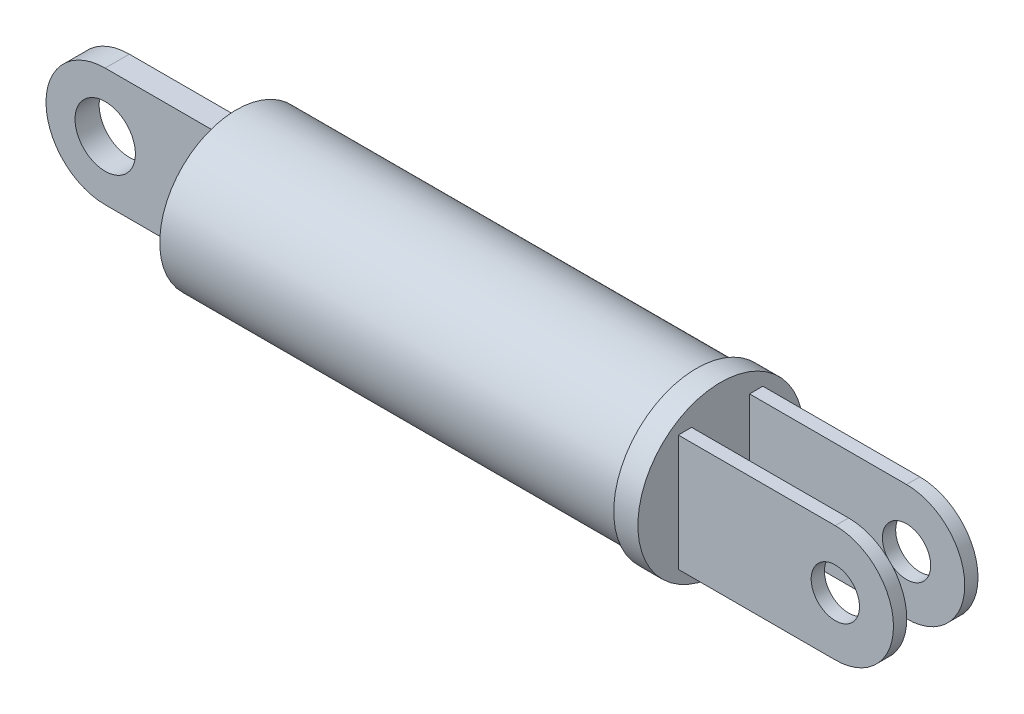
ISO-10303-21;
HEADER;
FILE_DESCRIPTION(('STEP AP214'),'2;1');
FILE_NAME('part.step','',(''),(''),'','','');
FILE_SCHEMA(('AUTOMOTIVE_DESIGN { 1 0 10303 214 1 1 1 1 }'));
ENDSEC;
DATA;
#1=APPLICATION_CONTEXT('core data for automotive mechanical design processes');
#2=APPLICATION_PROTOCOL_DEFINITION('international standard','automotive_design',2000,#1);
#3=PRODUCT_CONTEXT('',#1,'mechanical');
#4=PRODUCT('Part','Part','',(#3));
#5=PRODUCT_RELATED_PRODUCT_CATEGORY('part','',(#4));
#6=PRODUCT_DEFINITION_FORMATION('','',#4);
#7=PRODUCT_DEFINITION_CONTEXT('part definition',#1,'design');
#8=PRODUCT_DEFINITION('design','',#6,#7);
#9=PRODUCT_DEFINITION_SHAPE('','',#8);
#10=(LENGTH_UNIT() NAMED_UNIT(*) SI_UNIT(.MILLI.,.METRE.));
#11=(NAMED_UNIT(*) PLANE_ANGLE_UNIT() SI_UNIT($,.RADIAN.));
#12=(NAMED_UNIT(*) SI_UNIT($,.STERADIAN.) SOLID_ANGLE_UNIT());
#13=UNCERTAINTY_MEASURE_WITH_UNIT(LENGTH_MEASURE(1.E-05),#10,'distance_accuracy_value','');
#14=(GEOMETRIC_REPRESENTATION_CONTEXT(3) GLOBAL_UNCERTAINTY_ASSIGNED_CONTEXT((#13)) GLOBAL_UNIT_ASSIGNED_CONTEXT((#10,
#11,#12)) REPRESENTATION_CONTEXT('',''));
#15=CARTESIAN_POINT('',(0.,0.,0.));
#16=DIRECTION('',(0.,0.,1.));
#17=DIRECTION('',(1.,0.,0.));
#18=AXIS2_PLACEMENT_3D('',#15,#16,#17);
#19=CARTESIAN_POINT('',(80.2,-9.63566644208569,7.));
#20=DIRECTION('',(0.,1.,0.));
#21=DIRECTION('',(0.,0.,1.));
#22=AXIS2_PLACEMENT_3D('',#19,#20,#21);
#23=PLANE('',#22);
#24=DIRECTION('',(0.,0.,-1.));
#25=VECTOR('',#24,1.);
#26=CARTESIAN_POINT('',(106.2,-9.63566644208569,7.));
#27=LINE('',#26,#25);
#28=CARTESIAN_POINT('',(106.2,-9.63566644208569,-4.80121317375935));
#29=VERTEX_POINT('',#28);
#30=CARTESIAN_POINT('',(106.2,-9.63566644208569,-7.));
#31=VERTEX_POINT('',#30);
#32=EDGE_CURVE('E244',#29,#31,#27,.T.);
#33=ORIENTED_EDGE('',*,*,#32,.F.);
#34=DIRECTION('',(-1.,0.,0.));
#35=VECTOR('',#34,1.);
#36=CARTESIAN_POINT('',(80.2,-9.63566644208569,-4.80121317375934));
#37=LINE('',#36,#35);
#38=CARTESIAN_POINT('',(80.2,-9.63566644208569,-4.80121317375934));
#39=VERTEX_POINT('',#38);
#40=EDGE_CURVE('E211',#29,#39,#37,.T.);
#41=ORIENTED_EDGE('',*,*,#40,.T.);
#42=DIRECTION('',(0.,0.,-1.));
#43=VECTOR('',#42,1.);
#44=CARTESIAN_POINT('',(80.2,-9.63566644208569,7.));
#45=LINE('',#44,#43);
#46=CARTESIAN_POINT('',(80.2,-9.63566644208569,-7.));
#47=VERTEX_POINT('',#46);
#48=EDGE_CURVE('E147',#39,#47,#45,.T.);
#49=ORIENTED_EDGE('',*,*,#48,.T.);
#50=DIRECTION('',(1.,0.,0.));
#51=VECTOR('',#50,1.);
#52=CARTESIAN_POINT('',(80.2,-9.63566644208569,-7.));
#53=LINE('',#52,#51);
#54=EDGE_CURVE('E223',#47,#31,#53,.T.);
#55=ORIENTED_EDGE('',*,*,#54,.T.);
#56=EDGE_LOOP('',(#33,#41,#49,#55));
#57=FACE_BOUND('',#56,.T.);
#58=ADVANCED_FACE('F32',(#57),#23,.F.);
#59=CARTESIAN_POINT('',(106.2,0.,7.));
#60=DIRECTION('',(0.,0.,-1.));
#61=DIRECTION('',(-1.,0.,0.));
#62=AXIS2_PLACEMENT_3D('',#59,#60,#61);
#63=CYLINDRICAL_SURFACE('',#62,9.63566644208569);
#64=DIRECTION('',(0.,0.,-1.));
#65=VECTOR('',#64,1.);
#66=CARTESIAN_POINT('',(106.2,9.63566644208569,7.));
#67=LINE('',#66,#65);
#68=CARTESIAN_POINT('',(106.2,9.63566644208569,-4.80121317375935));
#69=VERTEX_POINT('',#68);
#70=CARTESIAN_POINT('',(106.2,9.63566644208569,-7.));
#71=VERTEX_POINT('',#70);
#72=EDGE_CURVE('E241',#69,#71,#67,.T.);
#73=ORIENTED_EDGE('',*,*,#72,.F.);
#74=CARTESIAN_POINT('',(106.2,0.,-4.80121317375935));
#75=DIRECTION('',(0.,0.,-1.));
#76=DIRECTION('',(-1.,0.,0.));
#77=AXIS2_PLACEMENT_3D('',#74,#75,#76);
#78=CIRCLE('',#77,9.63566644208569);
#79=EDGE_CURVE('E208',#69,#29,#78,.T.);
#80=ORIENTED_EDGE('',*,*,#79,.T.);
#81=ORIENTED_EDGE('',*,*,#32,.T.);
#82=CARTESIAN_POINT('',(106.2,0.,-7.));
#83=DIRECTION('',(0.,0.,1.));
#84=DIRECTION('',(-1.,0.,0.));
#85=AXIS2_PLACEMENT_3D('',#82,#83,#84);
#86=CIRCLE('',#85,9.63566644208569);
#87=EDGE_CURVE('E226',#31,#71,#86,.T.);
#88=ORIENTED_EDGE('',*,*,#87,.T.);
#89=EDGE_LOOP('',(#73,#80,#81,#88));
#90=FACE_BOUND('',#89,.T.);
#91=ADVANCED_FACE('F254',(#90),#63,.T.);
#92=CARTESIAN_POINT('',(80.2,9.63566644208569,7.));
#93=DIRECTION('',(0.,-1.,0.));
#94=DIRECTION('',(0.,0.,-1.));
#95=AXIS2_PLACEMENT_3D('',#92,#93,#94);
#96=PLANE('',#95);
#97=DIRECTION('',(0.,0.,-1.));
#98=VECTOR('',#97,1.);
#99=CARTESIAN_POINT('',(80.2,9.63566644208569,7.));
#100=LINE('',#99,#98);
#101=CARTESIAN_POINT('',(80.2,9.63566644208569,-4.80121317375934));
#102=VERTEX_POINT('',#101);
#103=CARTESIAN_POINT('',(80.2,9.63566644208569,-7.));
#104=VERTEX_POINT('',#103);
#105=EDGE_CURVE('E57',#102,#104,#100,.T.);
#106=ORIENTED_EDGE('',*,*,#105,.F.);
#107=DIRECTION('',(1.,0.,0.));
#108=VECTOR('',#107,1.);
#109=CARTESIAN_POINT('',(80.2,9.63566644208569,-4.80121317375934));
#110=LINE('',#109,#108);
#111=EDGE_CURVE('E205',#102,#69,#110,.T.);
#112=ORIENTED_EDGE('',*,*,#111,.T.);
#113=ORIENTED_EDGE('',*,*,#72,.T.);
#114=DIRECTION('',(-1.,0.,0.));
#115=VECTOR('',#114,1.);
#116=CARTESIAN_POINT('',(80.2,9.63566644208569,-7.));
#117=LINE('',#116,#115);
#118=EDGE_CURVE('E229',#71,#104,#117,.T.);
#119=ORIENTED_EDGE('',*,*,#118,.T.);
#120=EDGE_LOOP('',(#106,#112,#113,#119));
#121=FACE_BOUND('',#120,.T.);
#122=ADVANCED_FACE('F250',(#121),#96,.F.);
#123=CARTESIAN_POINT('',(106.2,0.,7.));
#124=DIRECTION('',(0.,0.,-1.));
#125=DIRECTION('',(-1.,0.,0.));
#126=AXIS2_PLACEMENT_3D('',#123,#124,#125);
#127=CYLINDRICAL_SURFACE('',#126,4.00000000000001);
#128=CARTESIAN_POINT('',(106.2,0.,-4.80121317375935));
#129=DIRECTION('',(0.,0.,-1.));
#130=DIRECTION('',(-1.,0.,0.));
#131=AXIS2_PLACEMENT_3D('',#128,#129,#130);
#132=CIRCLE('',#131,4.00000000000001);
#133=CARTESIAN_POINT('',(102.2,0.,-4.80121317375935));
#134=VERTEX_POINT('',#133);
#135=EDGE_CURVE('E36',#134,#134,#132,.T.);
#136=ORIENTED_EDGE('',*,*,#135,.F.);
#137=EDGE_LOOP('',(#136));
#138=FACE_BOUND('',#137,.T.);
#139=CARTESIAN_POINT('',(106.2,0.,-7.));
#140=DIRECTION('',(0.,0.,1.));
#141=DIRECTION('',(1.,0.,0.));
#142=AXIS2_PLACEMENT_3D('',#139,#140,#141);
#143=CIRCLE('',#142,4.00000000000001);
#144=CARTESIAN_POINT('',(110.2,0.,-7.));
#145=VERTEX_POINT('',#144);
#146=EDGE_CURVE('E214',#145,#145,#143,.T.);
#147=ORIENTED_EDGE('',*,*,#146,.F.);
#148=EDGE_LOOP('',(#147));
#149=FACE_BOUND('',#148,.T.);
#150=ADVANCED_FACE('F275',(#138,#149),#127,.F.);
#151=CARTESIAN_POINT('',(80.2,0.,0.));
#152=DIRECTION('',(1.,0.,0.));
#153=DIRECTION('',(0.,0.,-1.));
#154=AXIS2_PLACEMENT_3D('',#151,#152,#153);
#155=PLANE('',#154);
#156=ORIENTED_EDGE('',*,*,#48,.F.);
#157=DIRECTION('',(0.,1.,0.));
#158=VECTOR('',#157,1.);
#159=CARTESIAN_POINT('',(80.2,-13.7,-4.80121317375934));
#160=LINE('',#159,#158);
#161=EDGE_CURVE('E141',#39,#102,#160,.T.);
#162=ORIENTED_EDGE('',*,*,#161,.T.);
#163=ORIENTED_EDGE('',*,*,#105,.T.);
#164=DIRECTION('',(0.,-1.,0.));
#165=VECTOR('',#164,1.);
#166=CARTESIAN_POINT('',(80.2,9.63566644208569,-7.));
#167=LINE('',#166,#165);
#168=EDGE_CURVE('E221',#104,#47,#167,.T.);
#169=ORIENTED_EDGE('',*,*,#168,.T.);
#170=EDGE_LOOP('',(#156,#162,#163,#169));
#171=FACE_BOUND('',#170,.T.);
#172=CARTESIAN_POINT('',(80.2,9.63566644208569,7.));
#173=VERTEX_POINT('',#172);
#174=CARTESIAN_POINT('',(80.2,9.63566644208569,4.80121317375941));
#175=VERTEX_POINT('',#174);
#176=EDGE_CURVE('E140',#173,#175,#100,.T.);
#177=ORIENTED_EDGE('',*,*,#176,.T.);
#178=DIRECTION('',(0.,1.,0.));
#179=VECTOR('',#178,1.);
#180=CARTESIAN_POINT('',(80.2,-13.7,4.80121317375941));
#181=LINE('',#180,#179);
#182=CARTESIAN_POINT('',(80.2,-9.63566644208569,4.80121317375941));
#183=VERTEX_POINT('',#182);
#184=EDGE_CURVE('E49',#183,#175,#181,.T.);
#185=ORIENTED_EDGE('',*,*,#184,.F.);
#186=CARTESIAN_POINT('',(80.2,-9.63566644208569,7.));
#187=VERTEX_POINT('',#186);
#188=EDGE_CURVE('E138',#187,#183,#45,.T.);
#189=ORIENTED_EDGE('',*,*,#188,.F.);
#190=DIRECTION('',(0.,-1.,0.));
#191=VECTOR('',#190,1.);
#192=CARTESIAN_POINT('',(80.2,9.63566644208569,7.));
#193=LINE('',#192,#191);
#194=EDGE_CURVE('E232',#173,#187,#193,.T.);
#195=ORIENTED_EDGE('',*,*,#194,.F.);
#196=EDGE_LOOP('',(#177,#185,#189,#195));
#197=FACE_BOUND('',#196,.T.);
#198=CARTESIAN_POINT('',(80.2,0.,0.));
#199=DIRECTION('',(1.,0.,0.));
#200=DIRECTION('',(0.,0.,-1.));
#201=AXIS2_PLACEMENT_3D('',#198,#199,#200);
#202=CIRCLE('',#201,13.7);
#203=CARTESIAN_POINT('',(80.2,0.,-13.7));
#204=VERTEX_POINT('',#203);
#205=EDGE_CURVE('E150',#204,#204,#202,.T.);
#206=ORIENTED_EDGE('',*,*,#205,.T.);
#207=EDGE_LOOP('',(#206));
#208=FACE_BOUND('',#207,.T.);
#209=ADVANCED_FACE('F135',(#171,#197,#208),#155,.T.);
#210=CARTESIAN_POINT('',(0.,0.,0.));
#211=DIRECTION('',(1.,0.,0.));
#212=DIRECTION('',(0.,0.,-1.));
#213=AXIS2_PLACEMENT_3D('',#210,#211,#212);
#214=PLANE('',#213);
#215=CARTESIAN_POINT('',(0.,0.,0.));
#216=DIRECTION('',(1.,0.,0.));
#217=DIRECTION('',(0.,0.,-1.));
#218=AXIS2_PLACEMENT_3D('',#215,#216,#217);
#219=CIRCLE('',#218,12.7);
#220=CARTESIAN_POINT('',(0.,0.,-12.7));
#221=VERTEX_POINT('',#220);
#222=EDGE_CURVE('E41',#221,#221,#219,.T.);
#223=ORIENTED_EDGE('',*,*,#222,.F.);
#224=EDGE_LOOP('',(#223));
#225=FACE_BOUND('',#224,.T.);
#226=DIRECTION('',(0.,0.,-1.));
#227=VECTOR('',#226,1.);
#228=CARTESIAN_POINT('',(0.,9.80568754770044,2.));
#229=LINE('',#228,#227);
#230=CARTESIAN_POINT('',(0.,9.80568754770044,2.));
#231=VERTEX_POINT('',#230);
#232=CARTESIAN_POINT('',(0.,9.80568754770044,-2.));
#233=VERTEX_POINT('',#232);
#234=EDGE_CURVE('E191',#231,#233,#229,.T.);
#235=ORIENTED_EDGE('',*,*,#234,.F.);
#236=DIRECTION('',(0.,1.,0.));
#237=VECTOR('',#236,1.);
#238=CARTESIAN_POINT('',(0.,9.80568754770044,2.));
#239=LINE('',#238,#237);
#240=CARTESIAN_POINT('',(0.,-9.80568754770044,2.));
#241=VERTEX_POINT('',#240);
#242=EDGE_CURVE('E173',#241,#231,#239,.T.);
#243=ORIENTED_EDGE('',*,*,#242,.F.);
#244=DIRECTION('',(0.,0.,-1.));
#245=VECTOR('',#244,1.);
#246=CARTESIAN_POINT('',(0.,-9.80568754770044,2.));
#247=LINE('',#246,#245);
#248=CARTESIAN_POINT('',(0.,-9.80568754770044,-2.));
#249=VERTEX_POINT('',#248);
#250=EDGE_CURVE('E183',#241,#249,#247,.T.);
#251=ORIENTED_EDGE('',*,*,#250,.T.);
#252=DIRECTION('',(0.,1.,0.));
#253=VECTOR('',#252,1.);
#254=CARTESIAN_POINT('',(0.,9.80568754770044,-2.));
#255=LINE('',#254,#253);
#256=EDGE_CURVE('E164',#249,#233,#255,.T.);
#257=ORIENTED_EDGE('',*,*,#256,.T.);
#258=EDGE_LOOP('',(#235,#243,#251,#257));
#259=FACE_BOUND('',#258,.T.);
#260=ADVANCED_FACE('F311',(#225,#259),#214,.F.);
#261=CARTESIAN_POINT('',(76.2,0.,0.));
#262=DIRECTION('',(-1.,0.,0.));
#263=DIRECTION('',(0.,0.,1.));
#264=AXIS2_PLACEMENT_3D('',#261,#262,#263);
#265=CYLINDRICAL_SURFACE('',#264,12.7);
#266=CARTESIAN_POINT('',(76.2,0.,0.));
#267=DIRECTION('',(1.,0.,0.));
#268=DIRECTION('',(0.,0.,-1.));
#269=AXIS2_PLACEMENT_3D('',#266,#267,#268);
#270=CIRCLE('',#269,12.7);
#271=CARTESIAN_POINT('',(76.2,0.,-12.7));
#272=VERTEX_POINT('',#271);
#273=EDGE_CURVE('E11',#272,#272,#270,.T.);
#274=ORIENTED_EDGE('',*,*,#273,.F.);
#275=EDGE_LOOP('',(#274));
#276=FACE_BOUND('',#275,.T.);
#277=ORIENTED_EDGE('',*,*,#222,.T.);
#278=EDGE_LOOP('',(#277));
#279=FACE_BOUND('',#278,.T.);
#280=ADVANCED_FACE('F34',(#276,#279),#265,.T.);
#281=CARTESIAN_POINT('',(-19.7330944718316,0.,2.));
#282=DIRECTION('',(0.,0.,1.));
#283=DIRECTION('',(1.,0.,0.));
#284=AXIS2_PLACEMENT_3D('',#281,#282,#283);
#285=PLANE('',#284);
#286=ORIENTED_EDGE('',*,*,#242,.T.);
#287=DIRECTION('',(-1.,0.,0.));
#288=VECTOR('',#287,1.);
#289=CARTESIAN_POINT('',(0.,9.80568754770044,2.));
#290=LINE('',#289,#288);
#291=CARTESIAN_POINT('',(-19.7330944718316,9.80568754770044,2.));
#292=VERTEX_POINT('',#291);
#293=EDGE_CURVE('E176',#231,#292,#290,.T.);
#294=ORIENTED_EDGE('',*,*,#293,.T.);
#295=CARTESIAN_POINT('',(-19.7330944718316,0.,2.));
#296=DIRECTION('',(0.,0.,1.));
#297=DIRECTION('',(1.,0.,0.));
#298=AXIS2_PLACEMENT_3D('',#295,#296,#297);
#299=CIRCLE('',#298,9.80568754770044);
#300=CARTESIAN_POINT('',(-19.7330944718316,-9.80568754770044,2.));
#301=VERTEX_POINT('',#300);
#302=EDGE_CURVE('E178',#292,#301,#299,.T.);
#303=ORIENTED_EDGE('',*,*,#302,.T.);
#304=DIRECTION('',(1.,0.,0.));
#305=VECTOR('',#304,1.);
#306=CARTESIAN_POINT('',(0.,-9.80568754770044,2.));
#307=LINE('',#306,#305);
#308=EDGE_CURVE('E180',#301,#241,#307,.T.);
#309=ORIENTED_EDGE('',*,*,#308,.T.);
#310=EDGE_LOOP('',(#286,#294,#303,#309));
#311=FACE_BOUND('',#310,.T.);
#312=CARTESIAN_POINT('',(-19.7330944718316,0.,2.));
#313=DIRECTION('',(0.,0.,1.));
#314=DIRECTION('',(1.,0.,0.));
#315=AXIS2_PLACEMENT_3D('',#312,#313,#314);
#316=CIRCLE('',#315,5.);
#317=CARTESIAN_POINT('',(-14.7330944718316,0.,2.));
#318=VERTEX_POINT('',#317);
#319=EDGE_CURVE('E161',#318,#318,#316,.T.);
#320=ORIENTED_EDGE('',*,*,#319,.F.);
#321=EDGE_LOOP('',(#320));
#322=FACE_BOUND('',#321,.T.);
#323=ADVANCED_FACE('F334',(#311,#322),#285,.T.);
#324=CARTESIAN_POINT('',(-19.7330944718316,0.,-2.));
#325=DIRECTION('',(0.,0.,1.));
#326=DIRECTION('',(1.,0.,0.));
#327=AXIS2_PLACEMENT_3D('',#324,#325,#326);
#328=PLANE('',#327);
#329=ORIENTED_EDGE('',*,*,#256,.F.);
#330=DIRECTION('',(1.,0.,0.));
#331=VECTOR('',#330,1.);
#332=CARTESIAN_POINT('',(0.,-9.80568754770044,-2.));
#333=LINE('',#332,#331);
#334=CARTESIAN_POINT('',(-19.7330944718316,-9.80568754770044,-2.));
#335=VERTEX_POINT('',#334);
#336=EDGE_CURVE('E170',#335,#249,#333,.T.);
#337=ORIENTED_EDGE('',*,*,#336,.F.);
#338=CARTESIAN_POINT('',(-19.7330944718316,0.,-2.));
#339=DIRECTION('',(0.,0.,1.));
#340=DIRECTION('',(1.,0.,0.));
#341=AXIS2_PLACEMENT_3D('',#338,#339,#340);
#342=CIRCLE('',#341,9.80568754770044);
#343=CARTESIAN_POINT('',(-19.7330944718316,9.80568754770044,-2.));
#344=VERTEX_POINT('',#343);
#345=EDGE_CURVE('E168',#344,#335,#342,.T.);
#346=ORIENTED_EDGE('',*,*,#345,.F.);
#347=DIRECTION('',(-1.,0.,0.));
#348=VECTOR('',#347,1.);
#349=CARTESIAN_POINT('',(0.,9.80568754770044,-2.));
#350=LINE('',#349,#348);
#351=EDGE_CURVE('E166',#233,#344,#350,.T.);
#352=ORIENTED_EDGE('',*,*,#351,.F.);
#353=EDGE_LOOP('',(#329,#337,#346,#352));
#354=FACE_BOUND('',#353,.T.);
#355=CARTESIAN_POINT('',(-19.7330944718316,0.,-2.));
#356=DIRECTION('',(0.,0.,1.));
#357=DIRECTION('',(1.,0.,0.));
#358=AXIS2_PLACEMENT_3D('',#355,#356,#357);
#359=CIRCLE('',#358,5.);
#360=CARTESIAN_POINT('',(-14.7330944718316,0.,-2.));
#361=VERTEX_POINT('',#360);
#362=EDGE_CURVE('E158',#361,#361,#359,.T.);
#363=ORIENTED_EDGE('',*,*,#362,.T.);
#364=EDGE_LOOP('',(#363));
#365=FACE_BOUND('',#364,.T.);
#366=ADVANCED_FACE('F330',(#354,#365),#328,.F.);
#367=CARTESIAN_POINT('',(0.,9.80568754770044,2.));
#368=DIRECTION('',(0.,-1.,0.));
#369=DIRECTION('',(1.,0.,0.));
#370=AXIS2_PLACEMENT_3D('',#367,#368,#369);
#371=PLANE('',#370);
#372=ORIENTED_EDGE('',*,*,#351,.T.);
#373=DIRECTION('',(0.,0.,-1.));
#374=VECTOR('',#373,1.);
#375=CARTESIAN_POINT('',(-19.7330944718316,9.80568754770044,2.));
#376=LINE('',#375,#374);
#377=EDGE_CURVE('E188',#292,#344,#376,.T.);
#378=ORIENTED_EDGE('',*,*,#377,.F.);
#379=ORIENTED_EDGE('',*,*,#293,.F.);
#380=ORIENTED_EDGE('',*,*,#234,.T.);
#381=EDGE_LOOP('',(#372,#378,#379,#380));
#382=FACE_BOUND('',#381,.T.);
#383=ADVANCED_FACE('F333',(#382),#371,.F.);
#384=CARTESIAN_POINT('',(-19.7330944718316,0.,2.));
#385=DIRECTION('',(0.,0.,-1.));
#386=DIRECTION('',(-1.,0.,0.));
#387=AXIS2_PLACEMENT_3D('',#384,#385,#386);
#388=CYLINDRICAL_SURFACE('',#387,9.80568754770044);
#389=ORIENTED_EDGE('',*,*,#345,.T.);
#390=DIRECTION('',(0.,0.,-1.));
#391=VECTOR('',#390,1.);
#392=CARTESIAN_POINT('',(-19.7330944718316,-9.80568754770044,2.));
#393=LINE('',#392,#391);
#394=EDGE_CURVE('E185',#301,#335,#393,.T.);
#395=ORIENTED_EDGE('',*,*,#394,.F.);
#396=ORIENTED_EDGE('',*,*,#302,.F.);
#397=ORIENTED_EDGE('',*,*,#377,.T.);
#398=EDGE_LOOP('',(#389,#395,#396,#397));
#399=FACE_BOUND('',#398,.T.);
#400=ADVANCED_FACE('F341',(#399),#388,.T.);
#401=CARTESIAN_POINT('',(0.,-9.80568754770044,2.));
#402=DIRECTION('',(0.,1.,0.));
#403=DIRECTION('',(-1.,0.,0.));
#404=AXIS2_PLACEMENT_3D('',#401,#402,#403);
#405=PLANE('',#404);
#406=ORIENTED_EDGE('',*,*,#336,.T.);
#407=ORIENTED_EDGE('',*,*,#250,.F.);
#408=ORIENTED_EDGE('',*,*,#308,.F.);
#409=ORIENTED_EDGE('',*,*,#394,.T.);
#410=EDGE_LOOP('',(#406,#407,#408,#409));
#411=FACE_BOUND('',#410,.T.);
#412=ADVANCED_FACE('F328',(#411),#405,.F.);
#413=CARTESIAN_POINT('',(-19.7330944718316,0.,2.));
#414=DIRECTION('',(0.,0.,-1.));
#415=DIRECTION('',(-1.,0.,0.));
#416=AXIS2_PLACEMENT_3D('',#413,#414,#415);
#417=CYLINDRICAL_SURFACE('',#416,5.);
#418=ORIENTED_EDGE('',*,*,#319,.T.);
#419=EDGE_LOOP('',(#418));
#420=FACE_BOUND('',#419,.T.);
#421=ORIENTED_EDGE('',*,*,#362,.F.);
#422=EDGE_LOOP('',(#421));
#423=FACE_BOUND('',#422,.T.);
#424=ADVANCED_FACE('F325',(#420,#423),#417,.F.);
#425=CARTESIAN_POINT('',(76.2,0.,0.));
#426=DIRECTION('',(1.,0.,0.));
#427=DIRECTION('',(0.,0.,-1.));
#428=AXIS2_PLACEMENT_3D('',#425,#426,#427);
#429=PLANE('',#428);
#430=CARTESIAN_POINT('',(76.2,0.,0.));
#431=DIRECTION('',(1.,0.,0.));
#432=DIRECTION('',(0.,0.,-1.));
#433=AXIS2_PLACEMENT_3D('',#430,#431,#432);
#434=CIRCLE('',#433,13.7);
#435=CARTESIAN_POINT('',(76.2,0.,-13.7));
#436=VERTEX_POINT('',#435);
#437=EDGE_CURVE('E146',#436,#436,#434,.T.);
#438=ORIENTED_EDGE('',*,*,#437,.F.);
#439=EDGE_LOOP('',(#438));
#440=FACE_BOUND('',#439,.T.);
#441=ORIENTED_EDGE('',*,*,#273,.T.);
#442=EDGE_LOOP('',(#441));
#443=FACE_BOUND('',#442,.T.);
#444=ADVANCED_FACE('F321',(#440,#443),#429,.F.);
#445=CARTESIAN_POINT('',(80.2,0.,0.));
#446=DIRECTION('',(-1.,0.,0.));
#447=DIRECTION('',(0.,0.,1.));
#448=AXIS2_PLACEMENT_3D('',#445,#446,#447);
#449=CYLINDRICAL_SURFACE('',#448,13.7);
#450=ORIENTED_EDGE('',*,*,#205,.F.);
#451=EDGE_LOOP('',(#450));
#452=FACE_BOUND('',#451,.T.);
#453=ORIENTED_EDGE('',*,*,#437,.T.);
#454=EDGE_LOOP('',(#453));
#455=FACE_BOUND('',#454,.T.);
#456=ADVANCED_FACE('F296',(#452,#455),#449,.T.);
#457=CARTESIAN_POINT('',(106.2,0.,7.));
#458=DIRECTION('',(0.,0.,-1.));
#459=DIRECTION('',(-1.,0.,0.));
#460=AXIS2_PLACEMENT_3D('',#457,#458,#459);
#461=PLANE('',#460);
#462=ORIENTED_EDGE('',*,*,#194,.T.);
#463=DIRECTION('',(1.,0.,0.));
#464=VECTOR('',#463,1.);
#465=CARTESIAN_POINT('',(80.2,-9.63566644208569,7.));
#466=LINE('',#465,#464);
#467=CARTESIAN_POINT('',(106.2,-9.63566644208569,7.));
#468=VERTEX_POINT('',#467);
#469=EDGE_CURVE('E144',#187,#468,#466,.T.);
#470=ORIENTED_EDGE('',*,*,#469,.T.);
#471=CARTESIAN_POINT('',(106.2,0.,7.));
#472=DIRECTION('',(0.,0.,1.));
#473=DIRECTION('',(-1.,0.,0.));
#474=AXIS2_PLACEMENT_3D('',#471,#472,#473);
#475=CIRCLE('',#474,9.63566644208569);
#476=CARTESIAN_POINT('',(106.2,9.63566644208569,7.));
#477=VERTEX_POINT('',#476);
#478=EDGE_CURVE('E237',#468,#477,#475,.T.);
#479=ORIENTED_EDGE('',*,*,#478,.T.);
#480=DIRECTION('',(-1.,0.,0.));
#481=VECTOR('',#480,1.);
#482=CARTESIAN_POINT('',(80.2,9.63566644208569,7.));
#483=LINE('',#482,#481);
#484=EDGE_CURVE('E239',#477,#173,#483,.T.);
#485=ORIENTED_EDGE('',*,*,#484,.T.);
#486=EDGE_LOOP('',(#462,#470,#479,#485));
#487=FACE_BOUND('',#486,.T.);
#488=CARTESIAN_POINT('',(106.2,0.,7.));
#489=DIRECTION('',(0.,0.,1.));
#490=DIRECTION('',(1.,0.,0.));
#491=AXIS2_PLACEMENT_3D('',#488,#489,#490);
#492=CIRCLE('',#491,4.00000000000001);
#493=CARTESIAN_POINT('',(110.2,0.,7.));
#494=VERTEX_POINT('',#493);
#495=EDGE_CURVE('E217',#494,#494,#492,.T.);
#496=ORIENTED_EDGE('',*,*,#495,.F.);
#497=EDGE_LOOP('',(#496));
#498=FACE_BOUND('',#497,.T.);
#499=ADVANCED_FACE('F291',(#487,#498),#461,.F.);
#500=CARTESIAN_POINT('',(106.2,0.,-7.));
#501=DIRECTION('',(0.,0.,-1.));
#502=DIRECTION('',(-1.,0.,0.));
#503=AXIS2_PLACEMENT_3D('',#500,#501,#502);
#504=PLANE('',#503);
#505=ORIENTED_EDGE('',*,*,#168,.F.);
#506=ORIENTED_EDGE('',*,*,#118,.F.);
#507=ORIENTED_EDGE('',*,*,#87,.F.);
#508=ORIENTED_EDGE('',*,*,#54,.F.);
#509=EDGE_LOOP('',(#505,#506,#507,#508));
#510=FACE_BOUND('',#509,.T.);
#511=ORIENTED_EDGE('',*,*,#146,.T.);
#512=EDGE_LOOP('',(#511));
#513=FACE_BOUND('',#512,.T.);
#514=ADVANCED_FACE('F258',(#510,#513),#504,.T.);
#515=ORIENTED_EDGE('',*,*,#188,.T.);
#516=DIRECTION('',(1.,0.,0.));
#517=VECTOR('',#516,1.);
#518=CARTESIAN_POINT('',(80.2,-9.63566644208569,4.80121317375941));
#519=LINE('',#518,#517);
#520=CARTESIAN_POINT('',(106.2,-9.63566644208569,4.80121317375941));
#521=VERTEX_POINT('',#520);
#522=EDGE_CURVE('E123',#183,#521,#519,.T.);
#523=ORIENTED_EDGE('',*,*,#522,.T.);
#524=EDGE_CURVE('E152',#468,#521,#27,.T.);
#525=ORIENTED_EDGE('',*,*,#524,.F.);
#526=ORIENTED_EDGE('',*,*,#469,.F.);
#527=EDGE_LOOP('',(#515,#523,#525,#526));
#528=FACE_BOUND('',#527,.T.);
#529=ADVANCED_FACE('F143',(#528),#23,.F.);
#530=ORIENTED_EDGE('',*,*,#524,.T.);
#531=CARTESIAN_POINT('',(106.2,0.,4.80121317375941));
#532=DIRECTION('',(0.,0.,1.));
#533=DIRECTION('',(1.,0.,0.));
#534=AXIS2_PLACEMENT_3D('',#531,#532,#533);
#535=CIRCLE('',#534,9.63566644208569);
#536=CARTESIAN_POINT('',(106.2,9.63566644208569,4.80121317375941));
#537=VERTEX_POINT('',#536);
#538=EDGE_CURVE('E126',#521,#537,#535,.T.);
#539=ORIENTED_EDGE('',*,*,#538,.T.);
#540=EDGE_CURVE('E242',#477,#537,#67,.T.);
#541=ORIENTED_EDGE('',*,*,#540,.F.);
#542=ORIENTED_EDGE('',*,*,#478,.F.);
#543=EDGE_LOOP('',(#530,#539,#541,#542));
#544=FACE_BOUND('',#543,.T.);
#545=ADVANCED_FACE('F283',(#544),#63,.T.);
#546=ORIENTED_EDGE('',*,*,#540,.T.);
#547=DIRECTION('',(-1.,0.,0.));
#548=VECTOR('',#547,1.);
#549=CARTESIAN_POINT('',(80.2,9.63566644208569,4.80121317375941));
#550=LINE('',#549,#548);
#551=EDGE_CURVE('E197',#537,#175,#550,.T.);
#552=ORIENTED_EDGE('',*,*,#551,.T.);
#553=ORIENTED_EDGE('',*,*,#176,.F.);
#554=ORIENTED_EDGE('',*,*,#484,.F.);
#555=EDGE_LOOP('',(#546,#552,#553,#554));
#556=FACE_BOUND('',#555,.T.);
#557=ADVANCED_FACE('F272',(#556),#96,.F.);
#558=CARTESIAN_POINT('',(106.2,0.,4.80121317375941));
#559=DIRECTION('',(0.,0.,1.));
#560=DIRECTION('',(1.,0.,0.));
#561=AXIS2_PLACEMENT_3D('',#558,#559,#560);
#562=CIRCLE('',#561,4.00000000000001);
#563=CARTESIAN_POINT('',(110.2,0.,4.80121317375941));
#564=VERTEX_POINT('',#563);
#565=EDGE_CURVE('E195',#564,#564,#562,.T.);
#566=ORIENTED_EDGE('',*,*,#565,.F.);
#567=EDGE_LOOP('',(#566));
#568=FACE_BOUND('',#567,.T.);
#569=ORIENTED_EDGE('',*,*,#495,.T.);
#570=EDGE_LOOP('',(#569));
#571=FACE_BOUND('',#570,.T.);
#572=ADVANCED_FACE('F264',(#568,#571),#127,.F.);
#573=CARTESIAN_POINT('',(80.2,-13.7,-4.80121317375934));
#574=DIRECTION('',(0.,0.,-1.));
#575=DIRECTION('',(-1.,0.,0.));
#576=AXIS2_PLACEMENT_3D('',#573,#574,#575);
#577=PLANE('',#576);
#578=ORIENTED_EDGE('',*,*,#135,.T.);
#579=EDGE_LOOP('',(#578));
#580=FACE_BOUND('',#579,.T.);
#581=ORIENTED_EDGE('',*,*,#79,.F.);
#582=ORIENTED_EDGE('',*,*,#111,.F.);
#583=ORIENTED_EDGE('',*,*,#161,.F.);
#584=ORIENTED_EDGE('',*,*,#40,.F.);
#585=EDGE_LOOP('',(#581,#582,#583,#584));
#586=FACE_BOUND('',#585,.T.);
#587=ADVANCED_FACE('F262',(#580,#586),#577,.F.);
#588=CARTESIAN_POINT('',(80.2,-13.7,4.80121317375941));
#589=DIRECTION('',(0.,0.,1.));
#590=DIRECTION('',(1.,0.,0.));
#591=AXIS2_PLACEMENT_3D('',#588,#589,#590);
#592=PLANE('',#591);
#593=ORIENTED_EDGE('',*,*,#565,.T.);
#594=EDGE_LOOP('',(#593));
#595=FACE_BOUND('',#594,.T.);
#596=ORIENTED_EDGE('',*,*,#184,.T.);
#597=ORIENTED_EDGE('',*,*,#551,.F.);
#598=ORIENTED_EDGE('',*,*,#538,.F.);
#599=ORIENTED_EDGE('',*,*,#522,.F.);
#600=EDGE_LOOP('',(#596,#597,#598,#599));
#601=FACE_BOUND('',#600,.T.);
#602=ADVANCED_FACE('F124',(#595,#601),#592,.F.);
#603=CLOSED_SHELL('',(#58,#91,#122,#150,#209,#260,#280,#323,#366,#383,#400,#412,#424,#444,#456,
#499,#514,#529,#545,#557,#572,#587,#602));
#604=MANIFOLD_SOLID_BREP('B2',#603);
#605=ADVANCED_BREP_SHAPE_REPRESENTATION('',(#18,#604),#14);
#606=SHAPE_DEFINITION_REPRESENTATION(#9,#605);
ENDSEC;
END-ISO-10303-21;
